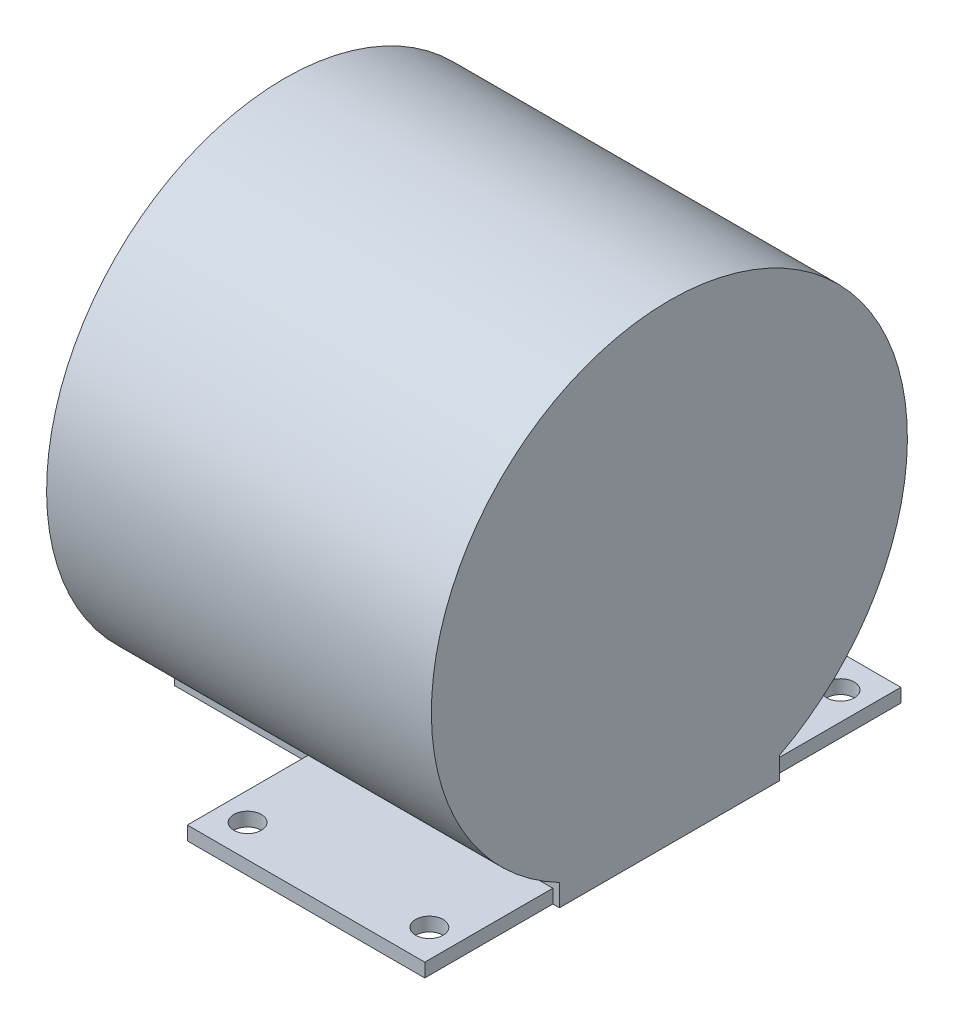
ISO-10303-21;
HEADER;
FILE_DESCRIPTION(('STEP AP214'),'2;1');
FILE_NAME('part.step','',(''),(''),'','','');
FILE_SCHEMA(('AUTOMOTIVE_DESIGN { 1 0 10303 214 1 1 1 1 }'));
ENDSEC;
DATA;
#1=APPLICATION_CONTEXT('core data for automotive mechanical design processes');
#2=APPLICATION_PROTOCOL_DEFINITION('international standard','automotive_design',2000,#1);
#3=PRODUCT_CONTEXT('',#1,'mechanical');
#4=PRODUCT('Part','Part','',(#3));
#5=PRODUCT_RELATED_PRODUCT_CATEGORY('part','',(#4));
#6=PRODUCT_DEFINITION_FORMATION('','',#4);
#7=PRODUCT_DEFINITION_CONTEXT('part definition',#1,'design');
#8=PRODUCT_DEFINITION('design','',#6,#7);
#9=PRODUCT_DEFINITION_SHAPE('','',#8);
#10=(LENGTH_UNIT() NAMED_UNIT(*) SI_UNIT(.MILLI.,.METRE.));
#11=(NAMED_UNIT(*) PLANE_ANGLE_UNIT() SI_UNIT($,.RADIAN.));
#12=(NAMED_UNIT(*) SI_UNIT($,.STERADIAN.) SOLID_ANGLE_UNIT());
#13=UNCERTAINTY_MEASURE_WITH_UNIT(LENGTH_MEASURE(1.E-05),#10,'distance_accuracy_value','');
#14=(GEOMETRIC_REPRESENTATION_CONTEXT(3) GLOBAL_UNCERTAINTY_ASSIGNED_CONTEXT((#13)) GLOBAL_UNIT_ASSIGNED_CONTEXT((#10,
#11,#12)) REPRESENTATION_CONTEXT('',''));
#15=CARTESIAN_POINT('',(0.,0.,0.));
#16=DIRECTION('',(0.,0.,1.));
#17=DIRECTION('',(1.,0.,0.));
#18=AXIS2_PLACEMENT_3D('',#15,#16,#17);
#19=CARTESIAN_POINT('',(-193.5033,-5.84199999999999,-95.25));
#20=DIRECTION('',(1.,0.,0.));
#21=DIRECTION('',(0.,0.,-1.));
#22=AXIS2_PLACEMENT_3D('',#19,#20,#21);
#23=CYLINDRICAL_SURFACE('',#22,54.991);
#24=CARTESIAN_POINT('',(-104.6033,-5.84199999999999,-95.25));
#25=DIRECTION('',(1.,0.,0.));
#26=DIRECTION('',(0.,0.,-1.));
#27=AXIS2_PLACEMENT_3D('',#24,#25,#26);
#28=CIRCLE('',#27,54.991);
#29=CARTESIAN_POINT('',(-104.6033,-54.6154567259693,-120.65));
#30=VERTEX_POINT('',#29);
#31=CARTESIAN_POINT('',(-104.6033,-54.6154567259693,-69.85));
#32=VERTEX_POINT('',#31);
#33=EDGE_CURVE('E188',#30,#32,#28,.T.);
#34=ORIENTED_EDGE('',*,*,#33,.F.);
#35=DIRECTION('',(1.,0.,0.));
#36=VECTOR('',#35,1.);
#37=CARTESIAN_POINT('',(-193.5033,-54.6154567259693,-120.65));
#38=LINE('',#37,#36);
#39=CARTESIAN_POINT('',(-193.5033,-54.6154567259693,-120.65));
#40=VERTEX_POINT('',#39);
#41=EDGE_CURVE('E213',#40,#30,#38,.T.);
#42=ORIENTED_EDGE('',*,*,#41,.F.);
#43=CARTESIAN_POINT('',(-193.5033,-5.84199999999999,-95.25));
#44=DIRECTION('',(1.,0.,0.));
#45=DIRECTION('',(0.,0.,-1.));
#46=AXIS2_PLACEMENT_3D('',#43,#44,#45);
#47=CIRCLE('',#46,54.991);
#48=CARTESIAN_POINT('',(-193.5033,-54.6154567259693,-69.85));
#49=VERTEX_POINT('',#48);
#50=EDGE_CURVE('E189',#40,#49,#47,.T.);
#51=ORIENTED_EDGE('',*,*,#50,.T.);
#52=DIRECTION('',(1.,0.,0.));
#53=VECTOR('',#52,1.);
#54=CARTESIAN_POINT('',(-193.5033,-54.6154567259693,-69.85));
#55=LINE('',#54,#53);
#56=EDGE_CURVE('E202',#49,#32,#55,.T.);
#57=ORIENTED_EDGE('',*,*,#56,.T.);
#58=EDGE_LOOP('',(#34,#42,#51,#57));
#59=FACE_BOUND('',#58,.T.);
#60=ADVANCED_FACE('F45',(#59),#23,.T.);
#61=CARTESIAN_POINT('',(-193.5033,-59.69,-120.65));
#62=DIRECTION('',(0.,0.,-1.));
#63=DIRECTION('',(-1.,0.,0.));
#64=AXIS2_PLACEMENT_3D('',#61,#62,#63);
#65=PLANE('',#64);
#66=DIRECTION('',(0.,-1.,0.));
#67=VECTOR('',#66,1.);
#68=CARTESIAN_POINT('',(-106.1273,-59.69,-120.65));
#69=LINE('',#68,#67);
#70=CARTESIAN_POINT('',(-106.1273,-56.515,-120.65));
#71=VERTEX_POINT('',#70);
#72=CARTESIAN_POINT('',(-106.1273,-59.69,-120.65));
#73=VERTEX_POINT('',#72);
#74=EDGE_CURVE('E186',#71,#73,#69,.T.);
#75=ORIENTED_EDGE('',*,*,#74,.F.);
#76=DIRECTION('',(-1.,0.,0.));
#77=VECTOR('',#76,1.);
#78=CARTESIAN_POINT('',(-193.5033,-56.515,-120.65));
#79=LINE('',#78,#77);
#80=CARTESIAN_POINT('',(-160.9913,-56.515,-120.65));
#81=VERTEX_POINT('',#80);
#82=EDGE_CURVE('E177',#71,#81,#79,.T.);
#83=ORIENTED_EDGE('',*,*,#82,.T.);
#84=DIRECTION('',(0.,1.,0.));
#85=VECTOR('',#84,1.);
#86=CARTESIAN_POINT('',(-160.9913,-59.69,-120.65));
#87=LINE('',#86,#85);
#88=CARTESIAN_POINT('',(-160.9913,-59.69,-120.65));
#89=VERTEX_POINT('',#88);
#90=EDGE_CURVE('E184',#89,#81,#87,.T.);
#91=ORIENTED_EDGE('',*,*,#90,.F.);
#92=DIRECTION('',(1.,0.,0.));
#93=VECTOR('',#92,1.);
#94=CARTESIAN_POINT('',(-193.5033,-59.69,-120.65));
#95=LINE('',#94,#93);
#96=CARTESIAN_POINT('',(-193.5033,-59.69,-120.65));
#97=VERTEX_POINT('',#96);
#98=EDGE_CURVE('E215',#97,#89,#95,.T.);
#99=ORIENTED_EDGE('',*,*,#98,.F.);
#100=DIRECTION('',(0.,1.,0.));
#101=VECTOR('',#100,1.);
#102=CARTESIAN_POINT('',(-193.5033,-59.69,-120.65));
#103=LINE('',#102,#101);
#104=EDGE_CURVE('E199',#97,#40,#103,.T.);
#105=ORIENTED_EDGE('',*,*,#104,.T.);
#106=ORIENTED_EDGE('',*,*,#41,.T.);
#107=DIRECTION('',(0.,1.,0.));
#108=VECTOR('',#107,1.);
#109=CARTESIAN_POINT('',(-104.6033,-59.69,-120.65));
#110=LINE('',#109,#108);
#111=CARTESIAN_POINT('',(-104.6033,-59.69,-120.65));
#112=VERTEX_POINT('',#111);
#113=EDGE_CURVE('E193',#112,#30,#110,.T.);
#114=ORIENTED_EDGE('',*,*,#113,.F.);
#115=EDGE_CURVE('E218',#73,#112,#95,.T.);
#116=ORIENTED_EDGE('',*,*,#115,.F.);
#117=EDGE_LOOP('',(#75,#83,#91,#99,#105,#106,#114,#116));
#118=FACE_BOUND('',#117,.T.);
#119=ADVANCED_FACE('F268',(#118),#65,.T.);
#120=CARTESIAN_POINT('',(-193.5033,-59.69,-69.85));
#121=DIRECTION('',(0.,-1.,0.));
#122=DIRECTION('',(0.,0.,-1.));
#123=AXIS2_PLACEMENT_3D('',#120,#121,#122);
#124=PLANE('',#123);
#125=ORIENTED_EDGE('',*,*,#98,.T.);
#126=DIRECTION('',(0.,0.,-1.));
#127=VECTOR('',#126,1.);
#128=CARTESIAN_POINT('',(-160.9913,-59.69,-40.259));
#129=LINE('',#128,#127);
#130=CARTESIAN_POINT('',(-160.9913,-59.69,-150.241));
#131=VERTEX_POINT('',#130);
#132=EDGE_CURVE('E170',#89,#131,#129,.T.);
#133=ORIENTED_EDGE('',*,*,#132,.T.);
#134=DIRECTION('',(1.,0.,0.));
#135=VECTOR('',#134,1.);
#136=CARTESIAN_POINT('',(-160.9913,-59.69,-150.241));
#137=LINE('',#136,#135);
#138=CARTESIAN_POINT('',(-106.1273,-59.69,-150.241));
#139=VERTEX_POINT('',#138);
#140=EDGE_CURVE('E143',#131,#139,#137,.T.);
#141=ORIENTED_EDGE('',*,*,#140,.T.);
#142=DIRECTION('',(0.,0.,1.));
#143=VECTOR('',#142,1.);
#144=CARTESIAN_POINT('',(-106.1273,-59.69,-40.259));
#145=LINE('',#144,#143);
#146=EDGE_CURVE('E59',#139,#73,#145,.T.);
#147=ORIENTED_EDGE('',*,*,#146,.T.);
#148=ORIENTED_EDGE('',*,*,#115,.T.);
#149=DIRECTION('',(0.,0.,-1.));
#150=VECTOR('',#149,1.);
#151=CARTESIAN_POINT('',(-104.6033,-59.69,-69.85));
#152=LINE('',#151,#150);
#153=CARTESIAN_POINT('',(-104.6033,-59.69,-69.85));
#154=VERTEX_POINT('',#153);
#155=EDGE_CURVE('E208',#154,#112,#152,.T.);
#156=ORIENTED_EDGE('',*,*,#155,.F.);
#157=DIRECTION('',(1.,0.,0.));
#158=VECTOR('',#157,1.);
#159=CARTESIAN_POINT('',(-193.5033,-59.69,-69.85));
#160=LINE('',#159,#158);
#161=CARTESIAN_POINT('',(-106.1273,-59.69,-69.85));
#162=VERTEX_POINT('',#161);
#163=EDGE_CURVE('E221',#162,#154,#160,.T.);
#164=ORIENTED_EDGE('',*,*,#163,.F.);
#165=CARTESIAN_POINT('',(-106.1273,-59.69,-40.259));
#166=VERTEX_POINT('',#165);
#167=EDGE_CURVE('E168',#162,#166,#145,.T.);
#168=ORIENTED_EDGE('',*,*,#167,.T.);
#169=DIRECTION('',(-1.,0.,0.));
#170=VECTOR('',#169,1.);
#171=CARTESIAN_POINT('',(-160.9913,-59.69,-40.259));
#172=LINE('',#171,#170);
#173=CARTESIAN_POINT('',(-160.9913,-59.69,-40.259));
#174=VERTEX_POINT('',#173);
#175=EDGE_CURVE('E150',#166,#174,#172,.T.);
#176=ORIENTED_EDGE('',*,*,#175,.T.);
#177=CARTESIAN_POINT('',(-160.9913,-59.69,-69.85));
#178=VERTEX_POINT('',#177);
#179=EDGE_CURVE('E171',#174,#178,#129,.T.);
#180=ORIENTED_EDGE('',*,*,#179,.T.);
#181=CARTESIAN_POINT('',(-193.5033,-59.69,-69.85));
#182=VERTEX_POINT('',#181);
#183=EDGE_CURVE('E219',#182,#178,#160,.T.);
#184=ORIENTED_EDGE('',*,*,#183,.F.);
#185=DIRECTION('',(0.,0.,-1.));
#186=VECTOR('',#185,1.);
#187=CARTESIAN_POINT('',(-193.5033,-59.69,-69.85));
#188=LINE('',#187,#186);
#189=EDGE_CURVE('E196',#182,#97,#188,.T.);
#190=ORIENTED_EDGE('',*,*,#189,.T.);
#191=EDGE_LOOP('',(#125,#133,#141,#147,#148,#156,#164,#168,#176,#180,#184,#190));
#192=FACE_BOUND('',#191,.T.);
#193=CARTESIAN_POINT('',(-154.5593,-59.69,-47.7499999999999));
#194=DIRECTION('',(0.,-1.,0.));
#195=DIRECTION('',(0.,0.,-1.));
#196=AXIS2_PLACEMENT_3D('',#193,#194,#195);
#197=CIRCLE('',#196,3.175);
#198=CARTESIAN_POINT('',(-154.5593,-59.69,-50.9249999999999));
#199=VERTEX_POINT('',#198);
#200=EDGE_CURVE('E252',#199,#199,#197,.T.);
#201=ORIENTED_EDGE('',*,*,#200,.F.);
#202=EDGE_LOOP('',(#201));
#203=FACE_BOUND('',#202,.T.);
#204=CARTESIAN_POINT('',(-112.5593,-59.69,-47.7499999999999));
#205=DIRECTION('',(0.,-1.,0.));
#206=DIRECTION('',(0.,0.,-1.));
#207=AXIS2_PLACEMENT_3D('',#204,#205,#206);
#208=CIRCLE('',#207,3.175);
#209=CARTESIAN_POINT('',(-112.5593,-59.69,-50.9249999999999));
#210=VERTEX_POINT('',#209);
#211=EDGE_CURVE('E246',#210,#210,#208,.T.);
#212=ORIENTED_EDGE('',*,*,#211,.F.);
#213=EDGE_LOOP('',(#212));
#214=FACE_BOUND('',#213,.T.);
#215=CARTESIAN_POINT('',(-112.5593,-59.69,-142.75));
#216=DIRECTION('',(0.,-1.,0.));
#217=DIRECTION('',(0.,0.,-1.));
#218=AXIS2_PLACEMENT_3D('',#215,#216,#217);
#219=CIRCLE('',#218,3.175);
#220=CARTESIAN_POINT('',(-112.5593,-59.69,-145.925));
#221=VERTEX_POINT('',#220);
#222=EDGE_CURVE('E233',#221,#221,#219,.T.);
#223=ORIENTED_EDGE('',*,*,#222,.F.);
#224=EDGE_LOOP('',(#223));
#225=FACE_BOUND('',#224,.T.);
#226=CARTESIAN_POINT('',(-154.5593,-59.69,-142.75));
#227=DIRECTION('',(0.,-1.,0.));
#228=DIRECTION('',(0.,0.,-1.));
#229=AXIS2_PLACEMENT_3D('',#226,#227,#228);
#230=CIRCLE('',#229,3.17499999999997);
#231=CARTESIAN_POINT('',(-154.5593,-59.69,-145.925));
#232=VERTEX_POINT('',#231);
#233=EDGE_CURVE('E240',#232,#232,#230,.T.);
#234=ORIENTED_EDGE('',*,*,#233,.F.);
#235=EDGE_LOOP('',(#234));
#236=FACE_BOUND('',#235,.T.);
#237=ADVANCED_FACE('F227',(#192,#203,#214,#225,#236),#124,.T.);
#238=CARTESIAN_POINT('',(-193.5033,-54.6154567259693,-69.85));
#239=DIRECTION('',(0.,0.,1.));
#240=DIRECTION('',(1.,0.,0.));
#241=AXIS2_PLACEMENT_3D('',#238,#239,#240);
#242=PLANE('',#241);
#243=DIRECTION('',(0.,1.,0.));
#244=VECTOR('',#243,1.);
#245=CARTESIAN_POINT('',(-106.1273,-54.6154567259693,-69.85));
#246=LINE('',#245,#244);
#247=CARTESIAN_POINT('',(-106.1273,-56.515,-69.85));
#248=VERTEX_POINT('',#247);
#249=EDGE_CURVE('E11',#162,#248,#246,.T.);
#250=ORIENTED_EDGE('',*,*,#249,.F.);
#251=ORIENTED_EDGE('',*,*,#163,.T.);
#252=DIRECTION('',(0.,-1.,0.));
#253=VECTOR('',#252,1.);
#254=CARTESIAN_POINT('',(-104.6033,-54.6154567259693,-69.85));
#255=LINE('',#254,#253);
#256=EDGE_CURVE('E205',#32,#154,#255,.T.);
#257=ORIENTED_EDGE('',*,*,#256,.F.);
#258=ORIENTED_EDGE('',*,*,#56,.F.);
#259=DIRECTION('',(0.,-1.,0.));
#260=VECTOR('',#259,1.);
#261=CARTESIAN_POINT('',(-193.5033,-54.6154567259693,-69.85));
#262=LINE('',#261,#260);
#263=EDGE_CURVE('E192',#49,#182,#262,.T.);
#264=ORIENTED_EDGE('',*,*,#263,.T.);
#265=ORIENTED_EDGE('',*,*,#183,.T.);
#266=DIRECTION('',(0.,-1.,0.));
#267=VECTOR('',#266,1.);
#268=CARTESIAN_POINT('',(-160.9913,-54.6154567259693,-69.85));
#269=LINE('',#268,#267);
#270=CARTESIAN_POINT('',(-160.9913,-56.515,-69.85));
#271=VERTEX_POINT('',#270);
#272=EDGE_CURVE('E52',#271,#178,#269,.T.);
#273=ORIENTED_EDGE('',*,*,#272,.F.);
#274=DIRECTION('',(1.,0.,0.));
#275=VECTOR('',#274,1.);
#276=CARTESIAN_POINT('',(-193.5033,-56.515,-69.85));
#277=LINE('',#276,#275);
#278=EDGE_CURVE('E67',#271,#248,#277,.T.);
#279=ORIENTED_EDGE('',*,*,#278,.T.);
#280=EDGE_LOOP('',(#250,#251,#257,#258,#264,#265,#273,#279));
#281=FACE_BOUND('',#280,.T.);
#282=ADVANCED_FACE('F267',(#281),#242,.T.);
#283=CARTESIAN_POINT('',(-193.5033,-5.84199999999999,-95.25));
#284=DIRECTION('',(1.,0.,0.));
#285=DIRECTION('',(0.,0.,-1.));
#286=AXIS2_PLACEMENT_3D('',#283,#284,#285);
#287=PLANE('',#286);
#288=ORIENTED_EDGE('',*,*,#50,.F.);
#289=ORIENTED_EDGE('',*,*,#104,.F.);
#290=ORIENTED_EDGE('',*,*,#189,.F.);
#291=ORIENTED_EDGE('',*,*,#263,.F.);
#292=EDGE_LOOP('',(#288,#289,#290,#291));
#293=FACE_BOUND('',#292,.T.);
#294=ADVANCED_FACE('F309',(#293),#287,.F.);
#295=CARTESIAN_POINT('',(-104.6033,-5.84199999999999,-95.25));
#296=DIRECTION('',(1.,0.,0.));
#297=DIRECTION('',(0.,0.,-1.));
#298=AXIS2_PLACEMENT_3D('',#295,#296,#297);
#299=PLANE('',#298);
#300=ORIENTED_EDGE('',*,*,#33,.T.);
#301=ORIENTED_EDGE('',*,*,#256,.T.);
#302=ORIENTED_EDGE('',*,*,#155,.T.);
#303=ORIENTED_EDGE('',*,*,#113,.T.);
#304=EDGE_LOOP('',(#300,#301,#302,#303));
#305=FACE_BOUND('',#304,.T.);
#306=ADVANCED_FACE('F303',(#305),#299,.T.);
#307=CARTESIAN_POINT('',(-160.9913,-56.515,-40.259));
#308=DIRECTION('',(0.,0.,1.));
#309=DIRECTION('',(1.,0.,0.));
#310=AXIS2_PLACEMENT_3D('',#307,#308,#309);
#311=PLANE('',#310);
#312=ORIENTED_EDGE('',*,*,#175,.F.);
#313=DIRECTION('',(0.,-1.,0.));
#314=VECTOR('',#313,1.);
#315=CARTESIAN_POINT('',(-106.1273,-56.515,-40.259));
#316=LINE('',#315,#314);
#317=CARTESIAN_POINT('',(-106.1273,-56.515,-40.259));
#318=VERTEX_POINT('',#317);
#319=EDGE_CURVE('E138',#318,#166,#316,.T.);
#320=ORIENTED_EDGE('',*,*,#319,.F.);
#321=DIRECTION('',(-1.,0.,0.));
#322=VECTOR('',#321,1.);
#323=CARTESIAN_POINT('',(-160.9913,-56.515,-40.259));
#324=LINE('',#323,#322);
#325=CARTESIAN_POINT('',(-160.9913,-56.515,-40.259));
#326=VERTEX_POINT('',#325);
#327=EDGE_CURVE('E148',#318,#326,#324,.T.);
#328=ORIENTED_EDGE('',*,*,#327,.T.);
#329=DIRECTION('',(0.,-1.,0.));
#330=VECTOR('',#329,1.);
#331=CARTESIAN_POINT('',(-160.9913,-56.515,-40.259));
#332=LINE('',#331,#330);
#333=EDGE_CURVE('E151',#326,#174,#332,.T.);
#334=ORIENTED_EDGE('',*,*,#333,.T.);
#335=EDGE_LOOP('',(#312,#320,#328,#334));
#336=FACE_BOUND('',#335,.T.);
#337=ADVANCED_FACE('F147',(#336),#311,.T.);
#338=CARTESIAN_POINT('',(-112.5593,-56.515,-47.7499999999999));
#339=DIRECTION('',(0.,-1.,0.));
#340=DIRECTION('',(0.,0.,-1.));
#341=AXIS2_PLACEMENT_3D('',#338,#339,#340);
#342=CYLINDRICAL_SURFACE('',#341,3.175);
#343=CARTESIAN_POINT('',(-112.5593,-56.515,-47.7499999999999));
#344=DIRECTION('',(0.,-1.,0.));
#345=DIRECTION('',(0.,0.,-1.));
#346=AXIS2_PLACEMENT_3D('',#343,#344,#345);
#347=CIRCLE('',#346,3.175);
#348=CARTESIAN_POINT('',(-112.5593,-56.515,-50.9249999999999));
#349=VERTEX_POINT('',#348);
#350=EDGE_CURVE('E243',#349,#349,#347,.T.);
#351=ORIENTED_EDGE('',*,*,#350,.F.);
#352=EDGE_LOOP('',(#351));
#353=FACE_BOUND('',#352,.T.);
#354=ORIENTED_EDGE('',*,*,#211,.T.);
#355=EDGE_LOOP('',(#354));
#356=FACE_BOUND('',#355,.T.);
#357=ADVANCED_FACE('F262',(#353,#356),#342,.F.);
#358=CARTESIAN_POINT('',(-154.5593,-56.515,-47.7499999999999));
#359=DIRECTION('',(0.,-1.,0.));
#360=DIRECTION('',(0.,0.,-1.));
#361=AXIS2_PLACEMENT_3D('',#358,#359,#360);
#362=CYLINDRICAL_SURFACE('',#361,3.175);
#363=CARTESIAN_POINT('',(-154.5593,-56.515,-47.7499999999999));
#364=DIRECTION('',(0.,-1.,0.));
#365=DIRECTION('',(0.,0.,-1.));
#366=AXIS2_PLACEMENT_3D('',#363,#364,#365);
#367=CIRCLE('',#366,3.175);
#368=CARTESIAN_POINT('',(-154.5593,-56.515,-50.9249999999999));
#369=VERTEX_POINT('',#368);
#370=EDGE_CURVE('E249',#369,#369,#367,.T.);
#371=ORIENTED_EDGE('',*,*,#370,.F.);
#372=EDGE_LOOP('',(#371));
#373=FACE_BOUND('',#372,.T.);
#374=ORIENTED_EDGE('',*,*,#200,.T.);
#375=EDGE_LOOP('',(#374));
#376=FACE_BOUND('',#375,.T.);
#377=ADVANCED_FACE('F259',(#373,#376),#362,.F.);
#378=CARTESIAN_POINT('',(0.,-56.515,0.));
#379=DIRECTION('',(0.,-1.,0.));
#380=DIRECTION('',(0.,0.,-1.));
#381=AXIS2_PLACEMENT_3D('',#378,#379,#380);
#382=PLANE('',#381);
#383=ORIENTED_EDGE('',*,*,#278,.F.);
#384=DIRECTION('',(0.,0.,-1.));
#385=VECTOR('',#384,1.);
#386=CARTESIAN_POINT('',(-160.9913,-56.515,-40.259));
#387=LINE('',#386,#385);
#388=EDGE_CURVE('E158',#326,#271,#387,.T.);
#389=ORIENTED_EDGE('',*,*,#388,.F.);
#390=ORIENTED_EDGE('',*,*,#327,.F.);
#391=DIRECTION('',(0.,0.,1.));
#392=VECTOR('',#391,1.);
#393=CARTESIAN_POINT('',(-106.1273,-56.515,-40.259));
#394=LINE('',#393,#392);
#395=EDGE_CURVE('E134',#248,#318,#394,.T.);
#396=ORIENTED_EDGE('',*,*,#395,.F.);
#397=EDGE_LOOP('',(#383,#389,#390,#396));
#398=FACE_BOUND('',#397,.T.);
#399=ORIENTED_EDGE('',*,*,#370,.T.);
#400=EDGE_LOOP('',(#399));
#401=FACE_BOUND('',#400,.T.);
#402=ORIENTED_EDGE('',*,*,#350,.T.);
#403=EDGE_LOOP('',(#402));
#404=FACE_BOUND('',#403,.T.);
#405=ADVANCED_FACE('F155',(#398,#401,#404),#382,.F.);
#406=CARTESIAN_POINT('',(-160.9913,-56.515,-40.259));
#407=DIRECTION('',(-1.,0.,0.));
#408=DIRECTION('',(0.,0.,1.));
#409=AXIS2_PLACEMENT_3D('',#406,#407,#408);
#410=PLANE('',#409);
#411=ORIENTED_EDGE('',*,*,#388,.T.);
#412=ORIENTED_EDGE('',*,*,#272,.T.);
#413=ORIENTED_EDGE('',*,*,#179,.F.);
#414=ORIENTED_EDGE('',*,*,#333,.F.);
#415=EDGE_LOOP('',(#411,#412,#413,#414));
#416=FACE_BOUND('',#415,.T.);
#417=ADVANCED_FACE('F226',(#416),#410,.T.);
#418=CARTESIAN_POINT('',(-106.1273,-56.515,-40.259));
#419=DIRECTION('',(1.,0.,0.));
#420=DIRECTION('',(0.,0.,-1.));
#421=AXIS2_PLACEMENT_3D('',#418,#419,#420);
#422=PLANE('',#421);
#423=ORIENTED_EDGE('',*,*,#167,.F.);
#424=ORIENTED_EDGE('',*,*,#249,.T.);
#425=ORIENTED_EDGE('',*,*,#395,.T.);
#426=ORIENTED_EDGE('',*,*,#319,.T.);
#427=EDGE_LOOP('',(#423,#424,#425,#426));
#428=FACE_BOUND('',#427,.T.);
#429=ADVANCED_FACE('F137',(#428),#422,.T.);
#430=CARTESIAN_POINT('',(-106.1273,-56.515,-150.241));
#431=VERTEX_POINT('',#430);
#432=EDGE_CURVE('E142',#431,#71,#394,.T.);
#433=ORIENTED_EDGE('',*,*,#432,.T.);
#434=ORIENTED_EDGE('',*,*,#74,.T.);
#435=ORIENTED_EDGE('',*,*,#146,.F.);
#436=DIRECTION('',(0.,-1.,0.));
#437=VECTOR('',#436,1.);
#438=CARTESIAN_POINT('',(-106.1273,-56.515,-150.241));
#439=LINE('',#438,#437);
#440=EDGE_CURVE('E175',#431,#139,#439,.T.);
#441=ORIENTED_EDGE('',*,*,#440,.F.);
#442=EDGE_LOOP('',(#433,#434,#435,#441));
#443=FACE_BOUND('',#442,.T.);
#444=ADVANCED_FACE('F322',(#443),#422,.T.);
#445=ORIENTED_EDGE('',*,*,#132,.F.);
#446=ORIENTED_EDGE('',*,*,#90,.T.);
#447=CARTESIAN_POINT('',(-160.9913,-56.515,-150.241));
#448=VERTEX_POINT('',#447);
#449=EDGE_CURVE('E159',#81,#448,#387,.T.);
#450=ORIENTED_EDGE('',*,*,#449,.T.);
#451=DIRECTION('',(0.,-1.,0.));
#452=VECTOR('',#451,1.);
#453=CARTESIAN_POINT('',(-160.9913,-56.515,-150.241));
#454=LINE('',#453,#452);
#455=EDGE_CURVE('E178',#448,#131,#454,.T.);
#456=ORIENTED_EDGE('',*,*,#455,.T.);
#457=EDGE_LOOP('',(#445,#446,#450,#456));
#458=FACE_BOUND('',#457,.T.);
#459=ADVANCED_FACE('F327',(#458),#410,.T.);
#460=ORIENTED_EDGE('',*,*,#82,.F.);
#461=ORIENTED_EDGE('',*,*,#432,.F.);
#462=DIRECTION('',(1.,0.,0.));
#463=VECTOR('',#462,1.);
#464=CARTESIAN_POINT('',(-160.9913,-56.515,-150.241));
#465=LINE('',#464,#463);
#466=EDGE_CURVE('E152',#448,#431,#465,.T.);
#467=ORIENTED_EDGE('',*,*,#466,.F.);
#468=ORIENTED_EDGE('',*,*,#449,.F.);
#469=EDGE_LOOP('',(#460,#461,#467,#468));
#470=FACE_BOUND('',#469,.T.);
#471=CARTESIAN_POINT('',(-112.5593,-56.515,-142.75));
#472=DIRECTION('',(0.,-1.,0.));
#473=DIRECTION('',(0.,0.,-1.));
#474=AXIS2_PLACEMENT_3D('',#471,#472,#473);
#475=CIRCLE('',#474,3.175);
#476=CARTESIAN_POINT('',(-112.5593,-56.515,-145.925));
#477=VERTEX_POINT('',#476);
#478=EDGE_CURVE('E231',#477,#477,#475,.T.);
#479=ORIENTED_EDGE('',*,*,#478,.T.);
#480=EDGE_LOOP('',(#479));
#481=FACE_BOUND('',#480,.T.);
#482=CARTESIAN_POINT('',(-154.5593,-56.515,-142.75));
#483=DIRECTION('',(0.,-1.,0.));
#484=DIRECTION('',(0.,0.,-1.));
#485=AXIS2_PLACEMENT_3D('',#482,#483,#484);
#486=CIRCLE('',#485,3.17499999999997);
#487=CARTESIAN_POINT('',(-154.5593,-56.515,-145.925));
#488=VERTEX_POINT('',#487);
#489=EDGE_CURVE('E238',#488,#488,#486,.T.);
#490=ORIENTED_EDGE('',*,*,#489,.T.);
#491=EDGE_LOOP('',(#490));
#492=FACE_BOUND('',#491,.T.);
#493=ADVANCED_FACE('F330',(#470,#481,#492),#382,.F.);
#494=CARTESIAN_POINT('',(-160.9913,-56.515,-150.241));
#495=DIRECTION('',(0.,0.,-1.));
#496=DIRECTION('',(-1.,0.,0.));
#497=AXIS2_PLACEMENT_3D('',#494,#495,#496);
#498=PLANE('',#497);
#499=ORIENTED_EDGE('',*,*,#140,.F.);
#500=ORIENTED_EDGE('',*,*,#455,.F.);
#501=ORIENTED_EDGE('',*,*,#466,.T.);
#502=ORIENTED_EDGE('',*,*,#440,.T.);
#503=EDGE_LOOP('',(#499,#500,#501,#502));
#504=FACE_BOUND('',#503,.T.);
#505=ADVANCED_FACE('F285',(#504),#498,.T.);
#506=CARTESIAN_POINT('',(-112.5593,-56.515,-142.75));
#507=DIRECTION('',(0.,-1.,0.));
#508=DIRECTION('',(0.,0.,-1.));
#509=AXIS2_PLACEMENT_3D('',#506,#507,#508);
#510=CYLINDRICAL_SURFACE('',#509,3.175);
#511=ORIENTED_EDGE('',*,*,#478,.F.);
#512=EDGE_LOOP('',(#511));
#513=FACE_BOUND('',#512,.T.);
#514=ORIENTED_EDGE('',*,*,#222,.T.);
#515=EDGE_LOOP('',(#514));
#516=FACE_BOUND('',#515,.T.);
#517=ADVANCED_FACE('F278',(#513,#516),#510,.F.);
#518=CARTESIAN_POINT('',(-154.5593,-56.515,-142.75));
#519=DIRECTION('',(0.,-1.,0.));
#520=DIRECTION('',(0.,0.,-1.));
#521=AXIS2_PLACEMENT_3D('',#518,#519,#520);
#522=CYLINDRICAL_SURFACE('',#521,3.17499999999997);
#523=ORIENTED_EDGE('',*,*,#489,.F.);
#524=EDGE_LOOP('',(#523));
#525=FACE_BOUND('',#524,.T.);
#526=ORIENTED_EDGE('',*,*,#233,.T.);
#527=EDGE_LOOP('',(#526));
#528=FACE_BOUND('',#527,.T.);
#529=ADVANCED_FACE('F276',(#525,#528),#522,.F.);
#530=CLOSED_SHELL('',(#60,#119,#237,#282,#294,#306,#337,#357,#377,#405,#417,#429,#444,#459,#493,
#505,#517,#529));
#531=MANIFOLD_SOLID_BREP('B2',#530);
#532=ADVANCED_BREP_SHAPE_REPRESENTATION('',(#18,#531),#14);
#533=SHAPE_DEFINITION_REPRESENTATION(#9,#532);
ENDSEC;
END-ISO-10303-21;
